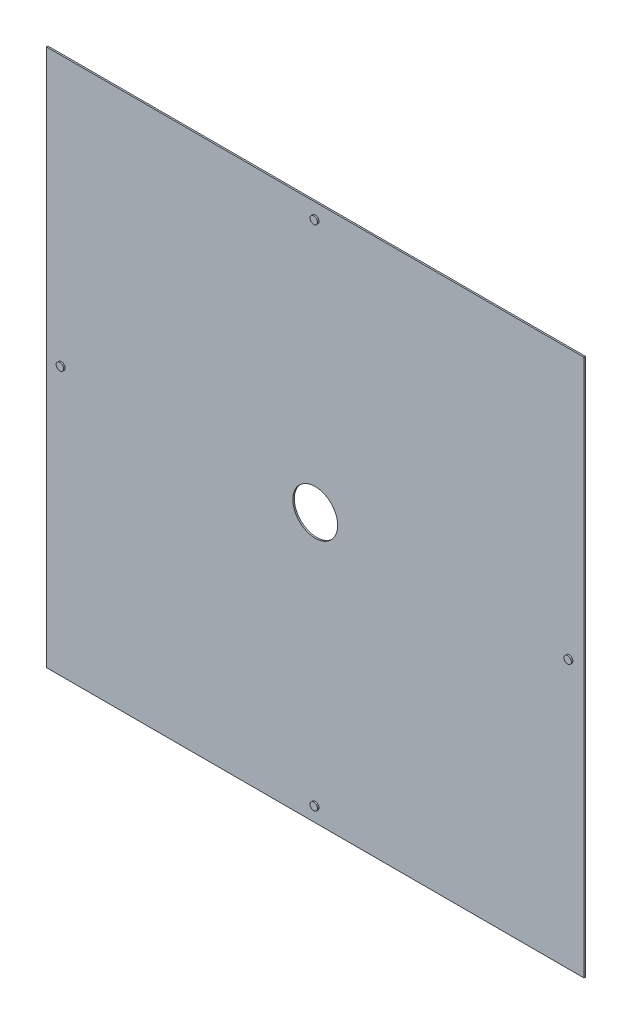
ISO-10303-21;
HEADER;
FILE_DESCRIPTION(('STEP AP214'),'2;1');
FILE_NAME('part.step','',(''),(''),'','','');
FILE_SCHEMA(('AUTOMOTIVE_DESIGN { 1 0 10303 214 1 1 1 1 }'));
ENDSEC;
DATA;
#1=APPLICATION_CONTEXT('core data for automotive mechanical design processes');
#2=APPLICATION_PROTOCOL_DEFINITION('international standard','automotive_design',2000,#1);
#3=PRODUCT_CONTEXT('',#1,'mechanical');
#4=PRODUCT('Part','Part','',(#3));
#5=PRODUCT_RELATED_PRODUCT_CATEGORY('part','',(#4));
#6=PRODUCT_DEFINITION_FORMATION('','',#4);
#7=PRODUCT_DEFINITION_CONTEXT('part definition',#1,'design');
#8=PRODUCT_DEFINITION('design','',#6,#7);
#9=PRODUCT_DEFINITION_SHAPE('','',#8);
#10=(LENGTH_UNIT() NAMED_UNIT(*) SI_UNIT(.MILLI.,.METRE.));
#11=(NAMED_UNIT(*) PLANE_ANGLE_UNIT() SI_UNIT($,.RADIAN.));
#12=(NAMED_UNIT(*) SI_UNIT($,.STERADIAN.) SOLID_ANGLE_UNIT());
#13=UNCERTAINTY_MEASURE_WITH_UNIT(LENGTH_MEASURE(1.E-05),#10,'distance_accuracy_value','');
#14=(GEOMETRIC_REPRESENTATION_CONTEXT(3) GLOBAL_UNCERTAINTY_ASSIGNED_CONTEXT((#13)) GLOBAL_UNIT_ASSIGNED_CONTEXT((#10,
#11,#12)) REPRESENTATION_CONTEXT('',''));
#15=CARTESIAN_POINT('',(0.,0.,0.));
#16=DIRECTION('',(0.,0.,1.));
#17=DIRECTION('',(1.,0.,0.));
#18=AXIS2_PLACEMENT_3D('',#15,#16,#17);
#19=CARTESIAN_POINT('',(0.,0.,2.));
#20=DIRECTION('',(0.,0.,1.));
#21=DIRECTION('',(1.,0.,0.));
#22=AXIS2_PLACEMENT_3D('',#19,#20,#21);
#23=PLANE('',#22);
#24=CARTESIAN_POINT('',(340.,0.,2.));
#25=DIRECTION('',(0.,0.,1.));
#26=DIRECTION('',(-1.,0.,0.));
#27=AXIS2_PLACEMENT_3D('',#24,#25,#26);
#28=CIRCLE('',#27,4.99999999999999);
#29=CARTESIAN_POINT('',(335.,0.,2.));
#30=VERTEX_POINT('',#29);
#31=EDGE_CURVE('E141',#30,#30,#28,.T.);
#32=ORIENTED_EDGE('',*,*,#31,.F.);
#33=EDGE_LOOP('',(#32));
#34=FACE_BOUND('',#33,.T.);
#35=CARTESIAN_POINT('',(0.,-340.,2.));
#36=DIRECTION('',(0.,0.,1.));
#37=DIRECTION('',(-1.,0.,0.));
#38=AXIS2_PLACEMENT_3D('',#35,#36,#37);
#39=CIRCLE('',#38,5.00000000000001);
#40=CARTESIAN_POINT('',(-5.00000000000006,-340.,2.));
#41=VERTEX_POINT('',#40);
#42=EDGE_CURVE('E135',#41,#41,#39,.T.);
#43=ORIENTED_EDGE('',*,*,#42,.F.);
#44=EDGE_LOOP('',(#43));
#45=FACE_BOUND('',#44,.T.);
#46=CARTESIAN_POINT('',(-340.,0.,2.));
#47=DIRECTION('',(0.,0.,1.));
#48=DIRECTION('',(1.,0.,0.));
#49=AXIS2_PLACEMENT_3D('',#46,#47,#48);
#50=CIRCLE('',#49,4.99999999999999);
#51=CARTESIAN_POINT('',(-335.,0.,2.));
#52=VERTEX_POINT('',#51);
#53=EDGE_CURVE('E129',#52,#52,#50,.T.);
#54=ORIENTED_EDGE('',*,*,#53,.F.);
#55=EDGE_LOOP('',(#54));
#56=FACE_BOUND('',#55,.T.);
#57=CARTESIAN_POINT('',(0.,340.,2.));
#58=DIRECTION('',(0.,0.,1.));
#59=DIRECTION('',(1.,0.,0.));
#60=AXIS2_PLACEMENT_3D('',#57,#58,#59);
#61=CIRCLE('',#60,5.00000000000001);
#62=CARTESIAN_POINT('',(4.99999999999995,340.,2.));
#63=VERTEX_POINT('',#62);
#64=EDGE_CURVE('E126',#63,#63,#61,.T.);
#65=ORIENTED_EDGE('',*,*,#64,.F.);
#66=EDGE_LOOP('',(#65));
#67=FACE_BOUND('',#66,.T.);
#68=DIRECTION('',(0.,1.,0.));
#69=VECTOR('',#68,1.);
#70=CARTESIAN_POINT('',(360.,360.,2.));
#71=LINE('',#70,#69);
#72=CARTESIAN_POINT('',(360.,-360.,2.));
#73=VERTEX_POINT('',#72);
#74=CARTESIAN_POINT('',(360.,360.,2.));
#75=VERTEX_POINT('',#74);
#76=EDGE_CURVE('E93',#73,#75,#71,.T.);
#77=ORIENTED_EDGE('',*,*,#76,.T.);
#78=DIRECTION('',(-1.,0.,0.));
#79=VECTOR('',#78,1.);
#80=CARTESIAN_POINT('',(-360.,360.,2.));
#81=LINE('',#80,#79);
#82=CARTESIAN_POINT('',(-360.,360.,2.));
#83=VERTEX_POINT('',#82);
#84=EDGE_CURVE('E88',#75,#83,#81,.T.);
#85=ORIENTED_EDGE('',*,*,#84,.T.);
#86=DIRECTION('',(0.,-1.,0.));
#87=VECTOR('',#86,1.);
#88=CARTESIAN_POINT('',(-360.,360.,2.));
#89=LINE('',#88,#87);
#90=CARTESIAN_POINT('',(-360.,-360.,2.));
#91=VERTEX_POINT('',#90);
#92=EDGE_CURVE('E91',#83,#91,#89,.T.);
#93=ORIENTED_EDGE('',*,*,#92,.T.);
#94=DIRECTION('',(1.,0.,0.));
#95=VECTOR('',#94,1.);
#96=CARTESIAN_POINT('',(-360.,-360.,2.));
#97=LINE('',#96,#95);
#98=EDGE_CURVE('E58',#91,#73,#97,.T.);
#99=ORIENTED_EDGE('',*,*,#98,.T.);
#100=EDGE_LOOP('',(#77,#85,#93,#99));
#101=FACE_BOUND('',#100,.T.);
#102=CARTESIAN_POINT('',(0.,0.,2.));
#103=DIRECTION('',(0.,0.,1.));
#104=DIRECTION('',(1.,0.,0.));
#105=AXIS2_PLACEMENT_3D('',#102,#103,#104);
#106=CIRCLE('',#105,30.);
#107=CARTESIAN_POINT('',(29.9999999999999,0.,2.));
#108=VERTEX_POINT('',#107);
#109=EDGE_CURVE('E108',#108,#108,#106,.T.);
#110=ORIENTED_EDGE('',*,*,#109,.F.);
#111=EDGE_LOOP('',(#110));
#112=FACE_BOUND('',#111,.T.);
#113=ADVANCED_FACE('F41',(#34,#45,#56,#67,#101,#112),#23,.T.);
#114=CARTESIAN_POINT('',(0.,0.,0.));
#115=DIRECTION('',(0.,0.,1.));
#116=DIRECTION('',(1.,0.,0.));
#117=AXIS2_PLACEMENT_3D('',#114,#115,#116);
#118=PLANE('',#117);
#119=DIRECTION('',(0.,1.,0.));
#120=VECTOR('',#119,1.);
#121=CARTESIAN_POINT('',(360.,360.,0.));
#122=LINE('',#121,#120);
#123=CARTESIAN_POINT('',(360.,-360.,0.));
#124=VERTEX_POINT('',#123);
#125=CARTESIAN_POINT('',(360.,360.,0.));
#126=VERTEX_POINT('',#125);
#127=EDGE_CURVE('E105',#124,#126,#122,.T.);
#128=ORIENTED_EDGE('',*,*,#127,.F.);
#129=DIRECTION('',(1.,0.,0.));
#130=VECTOR('',#129,1.);
#131=CARTESIAN_POINT('',(-360.,-360.,0.));
#132=LINE('',#131,#130);
#133=CARTESIAN_POINT('',(-360.,-360.,0.));
#134=VERTEX_POINT('',#133);
#135=EDGE_CURVE('E81',#134,#124,#132,.T.);
#136=ORIENTED_EDGE('',*,*,#135,.F.);
#137=DIRECTION('',(0.,-1.,0.));
#138=VECTOR('',#137,1.);
#139=CARTESIAN_POINT('',(-360.,360.,0.));
#140=LINE('',#139,#138);
#141=CARTESIAN_POINT('',(-360.,360.,0.));
#142=VERTEX_POINT('',#141);
#143=EDGE_CURVE('E75',#142,#134,#140,.T.);
#144=ORIENTED_EDGE('',*,*,#143,.F.);
#145=DIRECTION('',(-1.,0.,0.));
#146=VECTOR('',#145,1.);
#147=CARTESIAN_POINT('',(-360.,360.,0.));
#148=LINE('',#147,#146);
#149=EDGE_CURVE('E97',#126,#142,#148,.T.);
#150=ORIENTED_EDGE('',*,*,#149,.F.);
#151=EDGE_LOOP('',(#128,#136,#144,#150));
#152=FACE_BOUND('',#151,.T.);
#153=CARTESIAN_POINT('',(0.,0.,0.));
#154=DIRECTION('',(0.,0.,1.));
#155=DIRECTION('',(1.,0.,0.));
#156=AXIS2_PLACEMENT_3D('',#153,#154,#155);
#157=CIRCLE('',#156,30.);
#158=CARTESIAN_POINT('',(29.9999999999999,0.,0.));
#159=VERTEX_POINT('',#158);
#160=EDGE_CURVE('E120',#159,#159,#157,.T.);
#161=ORIENTED_EDGE('',*,*,#160,.T.);
#162=EDGE_LOOP('',(#161));
#163=FACE_BOUND('',#162,.T.);
#164=ADVANCED_FACE('F116',(#152,#163),#118,.F.);
#165=CARTESIAN_POINT('',(360.,360.,2.));
#166=DIRECTION('',(-1.,0.,0.));
#167=DIRECTION('',(0.,-1.,0.));
#168=AXIS2_PLACEMENT_3D('',#165,#166,#167);
#169=PLANE('',#168);
#170=ORIENTED_EDGE('',*,*,#127,.T.);
#171=DIRECTION('',(0.,0.,-1.));
#172=VECTOR('',#171,1.);
#173=CARTESIAN_POINT('',(360.,360.,2.));
#174=LINE('',#173,#172);
#175=EDGE_CURVE('E11',#75,#126,#174,.T.);
#176=ORIENTED_EDGE('',*,*,#175,.F.);
#177=ORIENTED_EDGE('',*,*,#76,.F.);
#178=DIRECTION('',(0.,0.,-1.));
#179=VECTOR('',#178,1.);
#180=CARTESIAN_POINT('',(360.,-360.,2.));
#181=LINE('',#180,#179);
#182=EDGE_CURVE('E101',#73,#124,#181,.T.);
#183=ORIENTED_EDGE('',*,*,#182,.T.);
#184=EDGE_LOOP('',(#170,#176,#177,#183));
#185=FACE_BOUND('',#184,.T.);
#186=ADVANCED_FACE('F43',(#185),#169,.F.);
#187=CARTESIAN_POINT('',(-360.,360.,2.));
#188=DIRECTION('',(0.,-1.,0.));
#189=DIRECTION('',(0.,0.,-1.));
#190=AXIS2_PLACEMENT_3D('',#187,#188,#189);
#191=PLANE('',#190);
#192=ORIENTED_EDGE('',*,*,#149,.T.);
#193=DIRECTION('',(0.,0.,-1.));
#194=VECTOR('',#193,1.);
#195=CARTESIAN_POINT('',(-360.,360.,2.));
#196=LINE('',#195,#194);
#197=EDGE_CURVE('E50',#83,#142,#196,.T.);
#198=ORIENTED_EDGE('',*,*,#197,.F.);
#199=ORIENTED_EDGE('',*,*,#84,.F.);
#200=ORIENTED_EDGE('',*,*,#175,.T.);
#201=EDGE_LOOP('',(#192,#198,#199,#200));
#202=FACE_BOUND('',#201,.T.);
#203=ADVANCED_FACE('F96',(#202),#191,.F.);
#204=CARTESIAN_POINT('',(-360.,360.,2.));
#205=DIRECTION('',(1.,0.,0.));
#206=DIRECTION('',(0.,1.,0.));
#207=AXIS2_PLACEMENT_3D('',#204,#205,#206);
#208=PLANE('',#207);
#209=ORIENTED_EDGE('',*,*,#143,.T.);
#210=DIRECTION('',(0.,0.,-1.));
#211=VECTOR('',#210,1.);
#212=CARTESIAN_POINT('',(-360.,-360.,2.));
#213=LINE('',#212,#211);
#214=EDGE_CURVE('E98',#91,#134,#213,.T.);
#215=ORIENTED_EDGE('',*,*,#214,.F.);
#216=ORIENTED_EDGE('',*,*,#92,.F.);
#217=ORIENTED_EDGE('',*,*,#197,.T.);
#218=EDGE_LOOP('',(#209,#215,#216,#217));
#219=FACE_BOUND('',#218,.T.);
#220=ADVANCED_FACE('F99',(#219),#208,.F.);
#221=CARTESIAN_POINT('',(-360.,-360.,2.));
#222=DIRECTION('',(0.,1.,0.));
#223=DIRECTION('',(0.,0.,1.));
#224=AXIS2_PLACEMENT_3D('',#221,#222,#223);
#225=PLANE('',#224);
#226=ORIENTED_EDGE('',*,*,#135,.T.);
#227=ORIENTED_EDGE('',*,*,#182,.F.);
#228=ORIENTED_EDGE('',*,*,#98,.F.);
#229=ORIENTED_EDGE('',*,*,#214,.T.);
#230=EDGE_LOOP('',(#226,#227,#228,#229));
#231=FACE_BOUND('',#230,.T.);
#232=ADVANCED_FACE('F113',(#231),#225,.F.);
#233=CARTESIAN_POINT('',(0.,0.,2.));
#234=DIRECTION('',(0.,0.,-1.));
#235=DIRECTION('',(-1.,0.,0.));
#236=AXIS2_PLACEMENT_3D('',#233,#234,#235);
#237=CYLINDRICAL_SURFACE('',#236,30.);
#238=ORIENTED_EDGE('',*,*,#109,.T.);
#239=EDGE_LOOP('',(#238));
#240=FACE_BOUND('',#239,.T.);
#241=ORIENTED_EDGE('',*,*,#160,.F.);
#242=EDGE_LOOP('',(#241));
#243=FACE_BOUND('',#242,.T.);
#244=ADVANCED_FACE('F164',(#240,#243),#237,.F.);
#245=CARTESIAN_POINT('',(0.,340.,4.));
#246=DIRECTION('',(0.,0.,-1.));
#247=DIRECTION('',(-1.,0.,0.));
#248=AXIS2_PLACEMENT_3D('',#245,#246,#247);
#249=CYLINDRICAL_SURFACE('',#248,5.00000000000001);
#250=CARTESIAN_POINT('',(0.,340.,4.));
#251=DIRECTION('',(0.,0.,1.));
#252=DIRECTION('',(1.,0.,0.));
#253=AXIS2_PLACEMENT_3D('',#250,#251,#252);
#254=CIRCLE('',#253,5.00000000000001);
#255=CARTESIAN_POINT('',(4.99999999999995,340.,4.));
#256=VERTEX_POINT('',#255);
#257=EDGE_CURVE('E123',#256,#256,#254,.T.);
#258=ORIENTED_EDGE('',*,*,#257,.F.);
#259=EDGE_LOOP('',(#258));
#260=FACE_BOUND('',#259,.T.);
#261=ORIENTED_EDGE('',*,*,#64,.T.);
#262=EDGE_LOOP('',(#261));
#263=FACE_BOUND('',#262,.T.);
#264=ADVANCED_FACE('F161',(#260,#263),#249,.T.);
#265=CARTESIAN_POINT('',(0.,340.,4.));
#266=DIRECTION('',(0.,0.,1.));
#267=DIRECTION('',(1.,0.,0.));
#268=AXIS2_PLACEMENT_3D('',#265,#266,#267);
#269=PLANE('',#268);
#270=ORIENTED_EDGE('',*,*,#257,.T.);
#271=EDGE_LOOP('',(#270));
#272=FACE_BOUND('',#271,.T.);
#273=ADVANCED_FACE('F163',(#272),#269,.T.);
#274=CARTESIAN_POINT('',(-340.,0.,4.));
#275=DIRECTION('',(0.,0.,-1.));
#276=DIRECTION('',(-1.,0.,0.));
#277=AXIS2_PLACEMENT_3D('',#274,#275,#276);
#278=CYLINDRICAL_SURFACE('',#277,4.99999999999999);
#279=CARTESIAN_POINT('',(-340.,0.,4.));
#280=DIRECTION('',(0.,0.,1.));
#281=DIRECTION('',(1.,0.,0.));
#282=AXIS2_PLACEMENT_3D('',#279,#280,#281);
#283=CIRCLE('',#282,4.99999999999999);
#284=CARTESIAN_POINT('',(-335.,0.,4.));
#285=VERTEX_POINT('',#284);
#286=EDGE_CURVE('E132',#285,#285,#283,.T.);
#287=ORIENTED_EDGE('',*,*,#286,.F.);
#288=EDGE_LOOP('',(#287));
#289=FACE_BOUND('',#288,.T.);
#290=ORIENTED_EDGE('',*,*,#53,.T.);
#291=EDGE_LOOP('',(#290));
#292=FACE_BOUND('',#291,.T.);
#293=ADVANCED_FACE('F171',(#289,#292),#278,.T.);
#294=CARTESIAN_POINT('',(-340.,0.,4.));
#295=DIRECTION('',(0.,0.,1.));
#296=DIRECTION('',(1.,0.,0.));
#297=AXIS2_PLACEMENT_3D('',#294,#295,#296);
#298=PLANE('',#297);
#299=ORIENTED_EDGE('',*,*,#286,.T.);
#300=EDGE_LOOP('',(#299));
#301=FACE_BOUND('',#300,.T.);
#302=ADVANCED_FACE('F224',(#301),#298,.T.);
#303=CARTESIAN_POINT('',(0.,-340.,4.));
#304=DIRECTION('',(0.,0.,-1.));
#305=DIRECTION('',(-1.,0.,0.));
#306=AXIS2_PLACEMENT_3D('',#303,#304,#305);
#307=CYLINDRICAL_SURFACE('',#306,5.00000000000001);
#308=CARTESIAN_POINT('',(0.,-340.,4.));
#309=DIRECTION('',(0.,0.,1.));
#310=DIRECTION('',(-1.,0.,0.));
#311=AXIS2_PLACEMENT_3D('',#308,#309,#310);
#312=CIRCLE('',#311,5.00000000000001);
#313=CARTESIAN_POINT('',(-5.00000000000006,-340.,4.));
#314=VERTEX_POINT('',#313);
#315=EDGE_CURVE('E138',#314,#314,#312,.T.);
#316=ORIENTED_EDGE('',*,*,#315,.F.);
#317=EDGE_LOOP('',(#316));
#318=FACE_BOUND('',#317,.T.);
#319=ORIENTED_EDGE('',*,*,#42,.T.);
#320=EDGE_LOOP('',(#319));
#321=FACE_BOUND('',#320,.T.);
#322=ADVANCED_FACE('F235',(#318,#321),#307,.T.);
#323=CARTESIAN_POINT('',(0.,-340.,4.));
#324=DIRECTION('',(0.,0.,-1.));
#325=DIRECTION('',(-1.,0.,0.));
#326=AXIS2_PLACEMENT_3D('',#323,#324,#325);
#327=PLANE('',#326);
#328=ORIENTED_EDGE('',*,*,#315,.T.);
#329=EDGE_LOOP('',(#328));
#330=FACE_BOUND('',#329,.T.);
#331=ADVANCED_FACE('F245',(#330),#327,.F.);
#332=CARTESIAN_POINT('',(340.,0.,4.));
#333=DIRECTION('',(0.,0.,-1.));
#334=DIRECTION('',(-1.,0.,0.));
#335=AXIS2_PLACEMENT_3D('',#332,#333,#334);
#336=CYLINDRICAL_SURFACE('',#335,4.99999999999999);
#337=CARTESIAN_POINT('',(340.,0.,4.));
#338=DIRECTION('',(0.,0.,1.));
#339=DIRECTION('',(-1.,0.,0.));
#340=AXIS2_PLACEMENT_3D('',#337,#338,#339);
#341=CIRCLE('',#340,4.99999999999999);
#342=CARTESIAN_POINT('',(335.,0.,4.));
#343=VERTEX_POINT('',#342);
#344=EDGE_CURVE('E144',#343,#343,#341,.T.);
#345=ORIENTED_EDGE('',*,*,#344,.F.);
#346=EDGE_LOOP('',(#345));
#347=FACE_BOUND('',#346,.T.);
#348=ORIENTED_EDGE('',*,*,#31,.T.);
#349=EDGE_LOOP('',(#348));
#350=FACE_BOUND('',#349,.T.);
#351=ADVANCED_FACE('F150',(#347,#350),#336,.T.);
#352=CARTESIAN_POINT('',(340.,0.,4.));
#353=DIRECTION('',(0.,0.,-1.));
#354=DIRECTION('',(-1.,0.,0.));
#355=AXIS2_PLACEMENT_3D('',#352,#353,#354);
#356=PLANE('',#355);
#357=ORIENTED_EDGE('',*,*,#344,.T.);
#358=EDGE_LOOP('',(#357));
#359=FACE_BOUND('',#358,.T.);
#360=ADVANCED_FACE('F266',(#359),#356,.F.);
#361=CLOSED_SHELL('',(#113,#164,#186,#203,#220,#232,#244,#264,#273,#293,#302,#322,#331,#351,#360));
#362=MANIFOLD_SOLID_BREP('B2',#361);
#363=ADVANCED_BREP_SHAPE_REPRESENTATION('',(#18,#362),#14);
#364=SHAPE_DEFINITION_REPRESENTATION(#9,#363);
ENDSEC;
END-ISO-10303-21;
